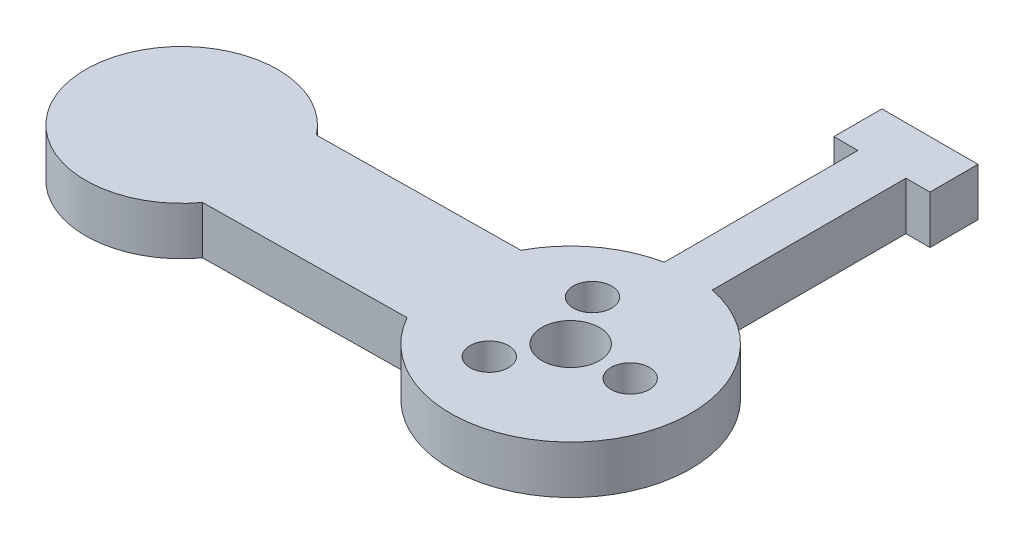
ISO-10303-21;
HEADER;
FILE_DESCRIPTION(('STEP AP214'),'2;1');
FILE_NAME('part.step','',(''),(''),'','','');
FILE_SCHEMA(('AUTOMOTIVE_DESIGN { 1 0 10303 214 1 1 1 1 }'));
ENDSEC;
DATA;
#1=APPLICATION_CONTEXT('core data for automotive mechanical design processes');
#2=APPLICATION_PROTOCOL_DEFINITION('international standard','automotive_design',2000,#1);
#3=PRODUCT_CONTEXT('',#1,'mechanical');
#4=PRODUCT('Part','Part','',(#3));
#5=PRODUCT_RELATED_PRODUCT_CATEGORY('part','',(#4));
#6=PRODUCT_DEFINITION_FORMATION('','',#4);
#7=PRODUCT_DEFINITION_CONTEXT('part definition',#1,'design');
#8=PRODUCT_DEFINITION('design','',#6,#7);
#9=PRODUCT_DEFINITION_SHAPE('','',#8);
#10=(LENGTH_UNIT() NAMED_UNIT(*) SI_UNIT(.MILLI.,.METRE.));
#11=(NAMED_UNIT(*) PLANE_ANGLE_UNIT() SI_UNIT($,.RADIAN.));
#12=(NAMED_UNIT(*) SI_UNIT($,.STERADIAN.) SOLID_ANGLE_UNIT());
#13=UNCERTAINTY_MEASURE_WITH_UNIT(LENGTH_MEASURE(1.E-05),#10,'distance_accuracy_value','');
#14=(GEOMETRIC_REPRESENTATION_CONTEXT(3) GLOBAL_UNCERTAINTY_ASSIGNED_CONTEXT((#13)) GLOBAL_UNIT_ASSIGNED_CONTEXT((#10,
#11,#12)) REPRESENTATION_CONTEXT('',''));
#15=CARTESIAN_POINT('',(0.,0.,0.));
#16=DIRECTION('',(0.,0.,1.));
#17=DIRECTION('',(1.,0.,0.));
#18=AXIS2_PLACEMENT_3D('',#15,#16,#17);
#19=CARTESIAN_POINT('',(-39.9970147864181,5.,0.488680033409613));
#20=DIRECTION('',(0.,-1.,0.));
#21=DIRECTION('',(0.,0.,-1.));
#22=AXIS2_PLACEMENT_3D('',#19,#20,#21);
#23=CYLINDRICAL_SURFACE('',#22,10.);
#24=CARTESIAN_POINT('',(-39.9970147864181,0.,0.488680033409613));
#25=DIRECTION('',(0.,1.,0.));
#26=DIRECTION('',(0.,0.,1.));
#27=AXIS2_PLACEMENT_3D('',#24,#25,#26);
#28=CIRCLE('',#27,10.);
#29=CARTESIAN_POINT('',(-32.0709138341459,0.,-5.60860819123503));
#30=VERTEX_POINT('',#29);
#31=CARTESIAN_POINT('',(-31.924309824123,0.,6.3904962446904));
#32=VERTEX_POINT('',#31);
#33=EDGE_CURVE('E189',#30,#32,#28,.T.);
#34=ORIENTED_EDGE('',*,*,#33,.T.);
#35=DIRECTION('',(0.,-1.,0.));
#36=VECTOR('',#35,1.);
#37=CARTESIAN_POINT('',(-31.924309824123,5.,6.3904962446904));
#38=LINE('',#37,#36);
#39=CARTESIAN_POINT('',(-31.924309824123,5.,6.3904962446904));
#40=VERTEX_POINT('',#39);
#41=EDGE_CURVE('E11',#40,#32,#38,.T.);
#42=ORIENTED_EDGE('',*,*,#41,.F.);
#43=CARTESIAN_POINT('',(-39.9970147864181,5.,0.488680033409613));
#44=DIRECTION('',(0.,1.,0.));
#45=DIRECTION('',(0.,0.,1.));
#46=AXIS2_PLACEMENT_3D('',#43,#44,#45);
#47=CIRCLE('',#46,10.);
#48=CARTESIAN_POINT('',(-32.0709138341459,5.,-5.60860819123503));
#49=VERTEX_POINT('',#48);
#50=EDGE_CURVE('E111',#49,#40,#47,.T.);
#51=ORIENTED_EDGE('',*,*,#50,.F.);
#52=DIRECTION('',(0.,-1.,0.));
#53=VECTOR('',#52,1.);
#54=CARTESIAN_POINT('',(-32.0709138341459,5.,-5.60860819123503));
#55=LINE('',#54,#53);
#56=EDGE_CURVE('E188',#49,#30,#55,.T.);
#57=ORIENTED_EDGE('',*,*,#56,.T.);
#58=EDGE_LOOP('',(#34,#42,#51,#57));
#59=FACE_BOUND('',#58,.T.);
#60=ADVANCED_FACE('F43',(#59),#23,.T.);
#61=CARTESIAN_POINT('',(0.073302005011442,5.,5.99955221796271));
#62=DIRECTION('',(0.0122170008352403,0.,0.999925369660452));
#63=DIRECTION('',(0.999925369660452,0.,-0.0122170008352403));
#64=AXIS2_PLACEMENT_3D('',#61,#62,#63);
#65=PLANE('',#64);
#66=DIRECTION('',(-0.999925369660452,0.,0.0122170008352403));
#67=VECTOR('',#66,1.);
#68=CARTESIAN_POINT('',(0.073302005011442,0.,5.99955221796271));
#69=LINE('',#68,#67);
#70=CARTESIAN_POINT('',(-10.8917357091551,0.,6.13352209109225));
#71=VERTEX_POINT('',#70);
#72=EDGE_CURVE('E193',#71,#32,#69,.T.);
#73=ORIENTED_EDGE('',*,*,#72,.F.);
#74=DIRECTION('',(0.,-1.,0.));
#75=VECTOR('',#74,1.);
#76=CARTESIAN_POINT('',(-10.8917357091551,5.,6.13352209109225));
#77=LINE('',#76,#75);
#78=CARTESIAN_POINT('',(-10.8917357091551,5.,6.13352209109225));
#79=VERTEX_POINT('',#78);
#80=EDGE_CURVE('E52',#79,#71,#77,.T.);
#81=ORIENTED_EDGE('',*,*,#80,.F.);
#82=DIRECTION('',(-0.999925369660452,0.,0.0122170008352403));
#83=VECTOR('',#82,1.);
#84=CARTESIAN_POINT('',(0.073302005011442,5.,5.99955221796271));
#85=LINE('',#84,#83);
#86=EDGE_CURVE('E281',#79,#40,#85,.T.);
#87=ORIENTED_EDGE('',*,*,#86,.T.);
#88=ORIENTED_EDGE('',*,*,#41,.T.);
#89=EDGE_LOOP('',(#73,#81,#87,#88));
#90=FACE_BOUND('',#89,.T.);
#91=ADVANCED_FACE('F280',(#90),#65,.T.);
#92=CARTESIAN_POINT('',(0.,5.,0.));
#93=DIRECTION('',(0.,-1.,0.));
#94=DIRECTION('',(0.,0.,-1.));
#95=AXIS2_PLACEMENT_3D('',#92,#93,#94);
#96=CYLINDRICAL_SURFACE('',#95,12.5);
#97=CARTESIAN_POINT('',(0.,0.,0.));
#98=DIRECTION('',(0.,1.,0.));
#99=DIRECTION('',(0.,0.,1.));
#100=AXIS2_PLACEMENT_3D('',#97,#98,#99);
#101=CIRCLE('',#100,12.5);
#102=CARTESIAN_POINT('',(2.5,0.,-12.2474487139159));
#103=VERTEX_POINT('',#102);
#104=EDGE_CURVE('E197',#71,#103,#101,.T.);
#105=ORIENTED_EDGE('',*,*,#104,.T.);
#106=DIRECTION('',(0.,-1.,0.));
#107=VECTOR('',#106,1.);
#108=CARTESIAN_POINT('',(2.5,5.,-12.2474487139159));
#109=LINE('',#108,#107);
#110=CARTESIAN_POINT('',(2.5,5.,-12.2474487139159));
#111=VERTEX_POINT('',#110);
#112=EDGE_CURVE('E262',#111,#103,#109,.T.);
#113=ORIENTED_EDGE('',*,*,#112,.F.);
#114=CARTESIAN_POINT('',(0.,5.,0.));
#115=DIRECTION('',(0.,1.,0.));
#116=DIRECTION('',(0.,0.,1.));
#117=AXIS2_PLACEMENT_3D('',#114,#115,#116);
#118=CIRCLE('',#117,12.5);
#119=EDGE_CURVE('E155',#79,#111,#118,.T.);
#120=ORIENTED_EDGE('',*,*,#119,.F.);
#121=ORIENTED_EDGE('',*,*,#80,.T.);
#122=EDGE_LOOP('',(#105,#113,#120,#121));
#123=FACE_BOUND('',#122,.T.);
#124=ADVANCED_FACE('F269',(#123),#96,.T.);
#125=CARTESIAN_POINT('',(2.5,5.,0.));
#126=DIRECTION('',(-1.,0.,0.));
#127=DIRECTION('',(0.,0.,1.));
#128=AXIS2_PLACEMENT_3D('',#125,#126,#127);
#129=PLANE('',#128);
#130=DIRECTION('',(0.,0.,-1.));
#131=VECTOR('',#130,1.);
#132=CARTESIAN_POINT('',(2.5,0.,0.));
#133=LINE('',#132,#131);
#134=CARTESIAN_POINT('',(2.5,0.,-32.4));
#135=VERTEX_POINT('',#134);
#136=EDGE_CURVE('E200',#103,#135,#133,.T.);
#137=ORIENTED_EDGE('',*,*,#136,.T.);
#138=DIRECTION('',(0.,-1.,0.));
#139=VECTOR('',#138,1.);
#140=CARTESIAN_POINT('',(2.5,5.,-32.4));
#141=LINE('',#140,#139);
#142=CARTESIAN_POINT('',(2.5,5.,-32.4));
#143=VERTEX_POINT('',#142);
#144=EDGE_CURVE('E258',#143,#135,#141,.T.);
#145=ORIENTED_EDGE('',*,*,#144,.F.);
#146=DIRECTION('',(0.,0.,-1.));
#147=VECTOR('',#146,1.);
#148=CARTESIAN_POINT('',(2.5,5.,0.));
#149=LINE('',#148,#147);
#150=EDGE_CURVE('E312',#111,#143,#149,.T.);
#151=ORIENTED_EDGE('',*,*,#150,.F.);
#152=ORIENTED_EDGE('',*,*,#112,.T.);
#153=EDGE_LOOP('',(#137,#145,#151,#152));
#154=FACE_BOUND('',#153,.T.);
#155=ADVANCED_FACE('F311',(#154),#129,.F.);
#156=CARTESIAN_POINT('',(0.,5.,-32.4));
#157=DIRECTION('',(0.,0.,-1.));
#158=DIRECTION('',(-1.,0.,0.));
#159=AXIS2_PLACEMENT_3D('',#156,#157,#158);
#160=PLANE('',#159);
#161=DIRECTION('',(1.,0.,0.));
#162=VECTOR('',#161,1.);
#163=CARTESIAN_POINT('',(0.,0.,-32.4));
#164=LINE('',#163,#162);
#165=CARTESIAN_POINT('',(5.,0.,-32.4));
#166=VERTEX_POINT('',#165);
#167=EDGE_CURVE('E203',#135,#166,#164,.T.);
#168=ORIENTED_EDGE('',*,*,#167,.T.);
#169=DIRECTION('',(0.,-1.,0.));
#170=VECTOR('',#169,1.);
#171=CARTESIAN_POINT('',(5.,5.,-32.4));
#172=LINE('',#171,#170);
#173=CARTESIAN_POINT('',(5.,5.,-32.4));
#174=VERTEX_POINT('',#173);
#175=EDGE_CURVE('E255',#174,#166,#172,.T.);
#176=ORIENTED_EDGE('',*,*,#175,.F.);
#177=DIRECTION('',(1.,0.,0.));
#178=VECTOR('',#177,1.);
#179=CARTESIAN_POINT('',(0.,5.,-32.4));
#180=LINE('',#179,#178);
#181=EDGE_CURVE('E166',#143,#174,#180,.T.);
#182=ORIENTED_EDGE('',*,*,#181,.F.);
#183=ORIENTED_EDGE('',*,*,#144,.T.);
#184=EDGE_LOOP('',(#168,#176,#182,#183));
#185=FACE_BOUND('',#184,.T.);
#186=ADVANCED_FACE('F306',(#185),#160,.F.);
#187=CARTESIAN_POINT('',(5.,5.,0.));
#188=DIRECTION('',(1.,0.,0.));
#189=DIRECTION('',(0.,0.,-1.));
#190=AXIS2_PLACEMENT_3D('',#187,#188,#189);
#191=PLANE('',#190);
#192=DIRECTION('',(0.,0.,1.));
#193=VECTOR('',#192,1.);
#194=CARTESIAN_POINT('',(5.,0.,0.));
#195=LINE('',#194,#193);
#196=CARTESIAN_POINT('',(5.,0.,-37.4));
#197=VERTEX_POINT('',#196);
#198=EDGE_CURVE('E207',#197,#166,#195,.T.);
#199=ORIENTED_EDGE('',*,*,#198,.F.);
#200=DIRECTION('',(0.,-1.,0.));
#201=VECTOR('',#200,1.);
#202=CARTESIAN_POINT('',(5.,5.,-37.4));
#203=LINE('',#202,#201);
#204=CARTESIAN_POINT('',(5.,5.,-37.4));
#205=VERTEX_POINT('',#204);
#206=EDGE_CURVE('E252',#205,#197,#203,.T.);
#207=ORIENTED_EDGE('',*,*,#206,.F.);
#208=DIRECTION('',(0.,0.,1.));
#209=VECTOR('',#208,1.);
#210=CARTESIAN_POINT('',(5.,5.,0.));
#211=LINE('',#210,#209);
#212=EDGE_CURVE('E317',#205,#174,#211,.T.);
#213=ORIENTED_EDGE('',*,*,#212,.T.);
#214=ORIENTED_EDGE('',*,*,#175,.T.);
#215=EDGE_LOOP('',(#199,#207,#213,#214));
#216=FACE_BOUND('',#215,.T.);
#217=ADVANCED_FACE('F303',(#216),#191,.T.);
#218=CARTESIAN_POINT('',(0.,5.,-37.4));
#219=DIRECTION('',(0.,0.,-1.));
#220=DIRECTION('',(-1.,0.,0.));
#221=AXIS2_PLACEMENT_3D('',#218,#219,#220);
#222=PLANE('',#221);
#223=DIRECTION('',(1.,0.,0.));
#224=VECTOR('',#223,1.);
#225=CARTESIAN_POINT('',(0.,0.,-37.4));
#226=LINE('',#225,#224);
#227=CARTESIAN_POINT('',(-5.,0.,-37.4));
#228=VERTEX_POINT('',#227);
#229=EDGE_CURVE('E212',#228,#197,#226,.T.);
#230=ORIENTED_EDGE('',*,*,#229,.F.);
#231=DIRECTION('',(0.,-1.,0.));
#232=VECTOR('',#231,1.);
#233=CARTESIAN_POINT('',(-5.,5.,-37.4));
#234=LINE('',#233,#232);
#235=CARTESIAN_POINT('',(-5.,5.,-37.4));
#236=VERTEX_POINT('',#235);
#237=EDGE_CURVE('E249',#236,#228,#234,.T.);
#238=ORIENTED_EDGE('',*,*,#237,.F.);
#239=DIRECTION('',(1.,0.,0.));
#240=VECTOR('',#239,1.);
#241=CARTESIAN_POINT('',(0.,5.,-37.4));
#242=LINE('',#241,#240);
#243=EDGE_CURVE('E299',#236,#205,#242,.T.);
#244=ORIENTED_EDGE('',*,*,#243,.T.);
#245=ORIENTED_EDGE('',*,*,#206,.T.);
#246=EDGE_LOOP('',(#230,#238,#244,#245));
#247=FACE_BOUND('',#246,.T.);
#248=ADVANCED_FACE('F294',(#247),#222,.T.);
#249=CARTESIAN_POINT('',(-5.,5.,0.));
#250=DIRECTION('',(1.,0.,0.));
#251=DIRECTION('',(0.,0.,-1.));
#252=AXIS2_PLACEMENT_3D('',#249,#250,#251);
#253=PLANE('',#252);
#254=DIRECTION('',(0.,0.,1.));
#255=VECTOR('',#254,1.);
#256=CARTESIAN_POINT('',(-5.,0.,0.));
#257=LINE('',#256,#255);
#258=CARTESIAN_POINT('',(-5.,0.,-32.4));
#259=VERTEX_POINT('',#258);
#260=EDGE_CURVE('E216',#228,#259,#257,.T.);
#261=ORIENTED_EDGE('',*,*,#260,.T.);
#262=DIRECTION('',(0.,-1.,0.));
#263=VECTOR('',#262,1.);
#264=CARTESIAN_POINT('',(-5.,5.,-32.4));
#265=LINE('',#264,#263);
#266=CARTESIAN_POINT('',(-5.,5.,-32.4));
#267=VERTEX_POINT('',#266);
#268=EDGE_CURVE('E245',#267,#259,#265,.T.);
#269=ORIENTED_EDGE('',*,*,#268,.F.);
#270=DIRECTION('',(0.,0.,1.));
#271=VECTOR('',#270,1.);
#272=CARTESIAN_POINT('',(-5.,5.,0.));
#273=LINE('',#272,#271);
#274=EDGE_CURVE('E164',#236,#267,#273,.T.);
#275=ORIENTED_EDGE('',*,*,#274,.F.);
#276=ORIENTED_EDGE('',*,*,#237,.T.);
#277=EDGE_LOOP('',(#261,#269,#275,#276));
#278=FACE_BOUND('',#277,.T.);
#279=ADVANCED_FACE('F323',(#278),#253,.F.);
#280=CARTESIAN_POINT('',(-2.5,0.,-32.4));
#281=VERTEX_POINT('',#280);
#282=EDGE_CURVE('E208',#259,#281,#164,.T.);
#283=ORIENTED_EDGE('',*,*,#282,.T.);
#284=DIRECTION('',(0.,-1.,0.));
#285=VECTOR('',#284,1.);
#286=CARTESIAN_POINT('',(-2.5,5.,-32.4));
#287=LINE('',#286,#285);
#288=CARTESIAN_POINT('',(-2.5,5.,-32.4));
#289=VERTEX_POINT('',#288);
#290=EDGE_CURVE('E148',#289,#281,#287,.T.);
#291=ORIENTED_EDGE('',*,*,#290,.F.);
#292=EDGE_CURVE('E159',#267,#289,#180,.T.);
#293=ORIENTED_EDGE('',*,*,#292,.F.);
#294=ORIENTED_EDGE('',*,*,#268,.T.);
#295=EDGE_LOOP('',(#283,#291,#293,#294));
#296=FACE_BOUND('',#295,.T.);
#297=ADVANCED_FACE('F288',(#296),#160,.F.);
#298=CARTESIAN_POINT('',(-2.5,5.,0.));
#299=DIRECTION('',(-1.,0.,0.));
#300=DIRECTION('',(0.,0.,1.));
#301=AXIS2_PLACEMENT_3D('',#298,#299,#300);
#302=PLANE('',#301);
#303=DIRECTION('',(0.,0.,-1.));
#304=VECTOR('',#303,1.);
#305=CARTESIAN_POINT('',(-2.5,0.,0.));
#306=LINE('',#305,#304);
#307=CARTESIAN_POINT('',(-2.5,0.,-12.2474487139159));
#308=VERTEX_POINT('',#307);
#309=EDGE_CURVE('E146',#308,#281,#306,.T.);
#310=ORIENTED_EDGE('',*,*,#309,.F.);
#311=DIRECTION('',(0.,-1.,0.));
#312=VECTOR('',#311,1.);
#313=CARTESIAN_POINT('',(-2.5,5.,-12.2474487139159));
#314=LINE('',#313,#312);
#315=CARTESIAN_POINT('',(-2.5,5.,-12.2474487139159));
#316=VERTEX_POINT('',#315);
#317=EDGE_CURVE('E140',#316,#308,#314,.T.);
#318=ORIENTED_EDGE('',*,*,#317,.F.);
#319=DIRECTION('',(0.,0.,-1.));
#320=VECTOR('',#319,1.);
#321=CARTESIAN_POINT('',(-2.5,5.,0.));
#322=LINE('',#321,#320);
#323=EDGE_CURVE('E144',#316,#289,#322,.T.);
#324=ORIENTED_EDGE('',*,*,#323,.T.);
#325=ORIENTED_EDGE('',*,*,#290,.T.);
#326=EDGE_LOOP('',(#310,#318,#324,#325));
#327=FACE_BOUND('',#326,.T.);
#328=ADVANCED_FACE('F142',(#327),#302,.T.);
#329=CARTESIAN_POINT('',(-11.0383397191779,0.,-5.86558234483318));
#330=VERTEX_POINT('',#329);
#331=EDGE_CURVE('E99',#308,#330,#101,.T.);
#332=ORIENTED_EDGE('',*,*,#331,.T.);
#333=DIRECTION('',(0.,-1.,0.));
#334=VECTOR('',#333,1.);
#335=CARTESIAN_POINT('',(-11.0383397191779,5.,-5.86558234483318));
#336=LINE('',#335,#334);
#337=CARTESIAN_POINT('',(-11.0383397191779,5.,-5.86558234483318));
#338=VERTEX_POINT('',#337);
#339=EDGE_CURVE('E149',#338,#330,#336,.T.);
#340=ORIENTED_EDGE('',*,*,#339,.F.);
#341=EDGE_CURVE('E151',#316,#338,#118,.T.);
#342=ORIENTED_EDGE('',*,*,#341,.F.);
#343=ORIENTED_EDGE('',*,*,#317,.T.);
#344=EDGE_LOOP('',(#332,#340,#342,#343));
#345=FACE_BOUND('',#344,.T.);
#346=ADVANCED_FACE('F152',(#345),#96,.T.);
#347=CARTESIAN_POINT('',(6.2,5.,0.));
#348=DIRECTION('',(0.,-1.,0.));
#349=DIRECTION('',(0.,0.,-1.));
#350=AXIS2_PLACEMENT_3D('',#347,#348,#349);
#351=CYLINDRICAL_SURFACE('',#350,2.);
#352=CARTESIAN_POINT('',(6.2,5.,0.));
#353=DIRECTION('',(0.,1.,0.));
#354=DIRECTION('',(0.,0.,1.));
#355=AXIS2_PLACEMENT_3D('',#352,#353,#354);
#356=CIRCLE('',#355,2.);
#357=CARTESIAN_POINT('',(6.2,5.,2.));
#358=VERTEX_POINT('',#357);
#359=EDGE_CURVE('E180',#358,#358,#356,.T.);
#360=ORIENTED_EDGE('',*,*,#359,.T.);
#361=EDGE_LOOP('',(#360));
#362=FACE_BOUND('',#361,.T.);
#363=CARTESIAN_POINT('',(6.2,0.,0.));
#364=DIRECTION('',(0.,1.,0.));
#365=DIRECTION('',(0.,0.,1.));
#366=AXIS2_PLACEMENT_3D('',#363,#364,#365);
#367=CIRCLE('',#366,2.);
#368=CARTESIAN_POINT('',(6.2,0.,2.));
#369=VERTEX_POINT('',#368);
#370=EDGE_CURVE('E231',#369,#369,#367,.T.);
#371=ORIENTED_EDGE('',*,*,#370,.F.);
#372=EDGE_LOOP('',(#371));
#373=FACE_BOUND('',#372,.T.);
#374=ADVANCED_FACE('F353',(#362,#373),#351,.F.);
#375=CARTESIAN_POINT('',(-3.1,5.,5.36935750346352));
#376=DIRECTION('',(0.,-1.,0.));
#377=DIRECTION('',(0.,0.,-1.));
#378=AXIS2_PLACEMENT_3D('',#375,#376,#377);
#379=CYLINDRICAL_SURFACE('',#378,2.);
#380=CARTESIAN_POINT('',(-3.1,5.,5.36935750346352));
#381=DIRECTION('',(0.,1.,0.));
#382=DIRECTION('',(0.,0.,1.));
#383=AXIS2_PLACEMENT_3D('',#380,#381,#382);
#384=CIRCLE('',#383,2.);
#385=CARTESIAN_POINT('',(-3.1,5.,7.36935750346352));
#386=VERTEX_POINT('',#385);
#387=EDGE_CURVE('E176',#386,#386,#384,.T.);
#388=ORIENTED_EDGE('',*,*,#387,.T.);
#389=EDGE_LOOP('',(#388));
#390=FACE_BOUND('',#389,.T.);
#391=CARTESIAN_POINT('',(-3.1,0.,5.36935750346352));
#392=DIRECTION('',(0.,1.,0.));
#393=DIRECTION('',(0.,0.,1.));
#394=AXIS2_PLACEMENT_3D('',#391,#392,#393);
#395=CIRCLE('',#394,2.);
#396=CARTESIAN_POINT('',(-3.1,0.,7.36935750346352));
#397=VERTEX_POINT('',#396);
#398=EDGE_CURVE('E227',#397,#397,#395,.T.);
#399=ORIENTED_EDGE('',*,*,#398,.F.);
#400=EDGE_LOOP('',(#399));
#401=FACE_BOUND('',#400,.T.);
#402=ADVANCED_FACE('F361',(#390,#401),#379,.F.);
#403=CARTESIAN_POINT('',(-3.1,5.,-5.36935750346352));
#404=DIRECTION('',(0.,-1.,0.));
#405=DIRECTION('',(0.,0.,-1.));
#406=AXIS2_PLACEMENT_3D('',#403,#404,#405);
#407=CYLINDRICAL_SURFACE('',#406,2.);
#408=CARTESIAN_POINT('',(-3.1,5.,-5.36935750346352));
#409=DIRECTION('',(0.,1.,0.));
#410=DIRECTION('',(0.,0.,1.));
#411=AXIS2_PLACEMENT_3D('',#408,#409,#410);
#412=CIRCLE('',#411,2.);
#413=CARTESIAN_POINT('',(-3.1,5.,-3.36935750346352));
#414=VERTEX_POINT('',#413);
#415=EDGE_CURVE('E172',#414,#414,#412,.T.);
#416=ORIENTED_EDGE('',*,*,#415,.T.);
#417=EDGE_LOOP('',(#416));
#418=FACE_BOUND('',#417,.T.);
#419=CARTESIAN_POINT('',(-3.1,0.,-5.36935750346352));
#420=DIRECTION('',(0.,1.,0.));
#421=DIRECTION('',(0.,0.,1.));
#422=AXIS2_PLACEMENT_3D('',#419,#420,#421);
#423=CIRCLE('',#422,2.);
#424=CARTESIAN_POINT('',(-3.1,0.,-3.36935750346352));
#425=VERTEX_POINT('',#424);
#426=EDGE_CURVE('E223',#425,#425,#423,.T.);
#427=ORIENTED_EDGE('',*,*,#426,.F.);
#428=EDGE_LOOP('',(#427));
#429=FACE_BOUND('',#428,.T.);
#430=ADVANCED_FACE('F358',(#418,#429),#407,.F.);
#431=CARTESIAN_POINT('',(-0.073302005011442,5.,-5.99955221796271));
#432=DIRECTION('',(0.0122170008352403,0.,0.999925369660452));
#433=DIRECTION('',(0.999925369660452,0.,-0.0122170008352403));
#434=AXIS2_PLACEMENT_3D('',#431,#432,#433);
#435=PLANE('',#434);
#436=DIRECTION('',(-0.999925369660452,0.,0.0122170008352403));
#437=VECTOR('',#436,1.);
#438=CARTESIAN_POINT('',(-0.073302005011442,0.,-5.99955221796271));
#439=LINE('',#438,#437);
#440=EDGE_CURVE('E105',#330,#30,#439,.T.);
#441=ORIENTED_EDGE('',*,*,#440,.T.);
#442=ORIENTED_EDGE('',*,*,#56,.F.);
#443=DIRECTION('',(-0.999925369660452,0.,0.0122170008352403));
#444=VECTOR('',#443,1.);
#445=CARTESIAN_POINT('',(-0.073302005011442,5.,-5.99955221796271));
#446=LINE('',#445,#444);
#447=EDGE_CURVE('E60',#338,#49,#446,.T.);
#448=ORIENTED_EDGE('',*,*,#447,.F.);
#449=ORIENTED_EDGE('',*,*,#339,.T.);
#450=EDGE_LOOP('',(#441,#442,#448,#449));
#451=FACE_BOUND('',#450,.T.);
#452=ADVANCED_FACE('F354',(#451),#435,.F.);
#453=CARTESIAN_POINT('',(0.,5.,0.));
#454=DIRECTION('',(0.,-1.,0.));
#455=DIRECTION('',(0.,0.,-1.));
#456=AXIS2_PLACEMENT_3D('',#453,#454,#455);
#457=CYLINDRICAL_SURFACE('',#456,3.);
#458=CARTESIAN_POINT('',(0.,5.,0.));
#459=DIRECTION('',(0.,1.,0.));
#460=DIRECTION('',(0.,0.,1.));
#461=AXIS2_PLACEMENT_3D('',#458,#459,#460);
#462=CIRCLE('',#461,3.);
#463=CARTESIAN_POINT('',(0.,5.,3.));
#464=VERTEX_POINT('',#463);
#465=EDGE_CURVE('E184',#464,#464,#462,.T.);
#466=ORIENTED_EDGE('',*,*,#465,.T.);
#467=EDGE_LOOP('',(#466));
#468=FACE_BOUND('',#467,.T.);
#469=CARTESIAN_POINT('',(0.,0.,0.));
#470=DIRECTION('',(0.,1.,0.));
#471=DIRECTION('',(0.,0.,1.));
#472=AXIS2_PLACEMENT_3D('',#469,#470,#471);
#473=CIRCLE('',#472,3.);
#474=CARTESIAN_POINT('',(0.,0.,3.));
#475=VERTEX_POINT('',#474);
#476=EDGE_CURVE('E235',#475,#475,#473,.T.);
#477=ORIENTED_EDGE('',*,*,#476,.F.);
#478=EDGE_LOOP('',(#477));
#479=FACE_BOUND('',#478,.T.);
#480=ADVANCED_FACE('F357',(#468,#479),#457,.F.);
#481=CARTESIAN_POINT('',(0.,5.,0.));
#482=DIRECTION('',(0.,1.,0.));
#483=DIRECTION('',(0.,0.,1.));
#484=AXIS2_PLACEMENT_3D('',#481,#482,#483);
#485=PLANE('',#484);
#486=ORIENTED_EDGE('',*,*,#50,.T.);
#487=ORIENTED_EDGE('',*,*,#86,.F.);
#488=ORIENTED_EDGE('',*,*,#119,.T.);
#489=ORIENTED_EDGE('',*,*,#150,.T.);
#490=ORIENTED_EDGE('',*,*,#181,.T.);
#491=ORIENTED_EDGE('',*,*,#212,.F.);
#492=ORIENTED_EDGE('',*,*,#243,.F.);
#493=ORIENTED_EDGE('',*,*,#274,.T.);
#494=ORIENTED_EDGE('',*,*,#292,.T.);
#495=ORIENTED_EDGE('',*,*,#323,.F.);
#496=ORIENTED_EDGE('',*,*,#341,.T.);
#497=ORIENTED_EDGE('',*,*,#447,.T.);
#498=EDGE_LOOP('',(#486,#487,#488,#489,#490,#491,#492,#493,#494,#495,#496,#497));
#499=FACE_BOUND('',#498,.T.);
#500=ORIENTED_EDGE('',*,*,#415,.F.);
#501=EDGE_LOOP('',(#500));
#502=FACE_BOUND('',#501,.T.);
#503=ORIENTED_EDGE('',*,*,#387,.F.);
#504=EDGE_LOOP('',(#503));
#505=FACE_BOUND('',#504,.T.);
#506=ORIENTED_EDGE('',*,*,#359,.F.);
#507=EDGE_LOOP('',(#506));
#508=FACE_BOUND('',#507,.T.);
#509=ORIENTED_EDGE('',*,*,#465,.F.);
#510=EDGE_LOOP('',(#509));
#511=FACE_BOUND('',#510,.T.);
#512=ADVANCED_FACE('F156',(#499,#502,#505,#508,#511),#485,.T.);
#513=CARTESIAN_POINT('',(0.,0.,0.));
#514=DIRECTION('',(0.,1.,0.));
#515=DIRECTION('',(0.,0.,1.));
#516=AXIS2_PLACEMENT_3D('',#513,#514,#515);
#517=PLANE('',#516);
#518=ORIENTED_EDGE('',*,*,#33,.F.);
#519=ORIENTED_EDGE('',*,*,#440,.F.);
#520=ORIENTED_EDGE('',*,*,#331,.F.);
#521=ORIENTED_EDGE('',*,*,#309,.T.);
#522=ORIENTED_EDGE('',*,*,#282,.F.);
#523=ORIENTED_EDGE('',*,*,#260,.F.);
#524=ORIENTED_EDGE('',*,*,#229,.T.);
#525=ORIENTED_EDGE('',*,*,#198,.T.);
#526=ORIENTED_EDGE('',*,*,#167,.F.);
#527=ORIENTED_EDGE('',*,*,#136,.F.);
#528=ORIENTED_EDGE('',*,*,#104,.F.);
#529=ORIENTED_EDGE('',*,*,#72,.T.);
#530=EDGE_LOOP('',(#518,#519,#520,#521,#522,#523,#524,#525,#526,#527,#528,#529));
#531=FACE_BOUND('',#530,.T.);
#532=ORIENTED_EDGE('',*,*,#426,.T.);
#533=EDGE_LOOP('',(#532));
#534=FACE_BOUND('',#533,.T.);
#535=ORIENTED_EDGE('',*,*,#398,.T.);
#536=EDGE_LOOP('',(#535));
#537=FACE_BOUND('',#536,.T.);
#538=ORIENTED_EDGE('',*,*,#370,.T.);
#539=EDGE_LOOP('',(#538));
#540=FACE_BOUND('',#539,.T.);
#541=ORIENTED_EDGE('',*,*,#476,.T.);
#542=EDGE_LOOP('',(#541));
#543=FACE_BOUND('',#542,.T.);
#544=ADVANCED_FACE('F277',(#531,#534,#537,#540,#543),#517,.F.);
#545=CLOSED_SHELL('',(#60,#91,#124,#155,#186,#217,#248,#279,#297,#328,#346,#374,#402,#430,#452,
#480,#512,#544));
#546=MANIFOLD_SOLID_BREP('B2',#545);
#547=ADVANCED_BREP_SHAPE_REPRESENTATION('',(#18,#546),#14);
#548=SHAPE_DEFINITION_REPRESENTATION(#9,#547);
ENDSEC;
END-ISO-10303-21;
